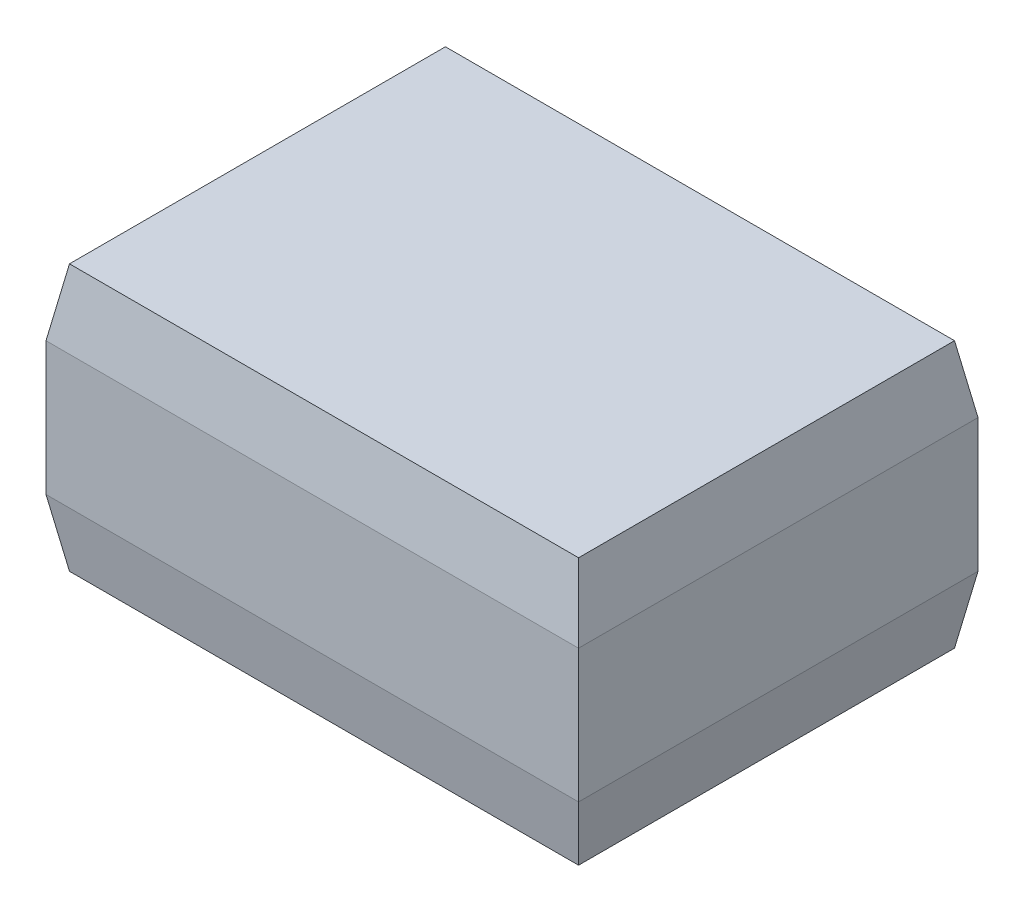
ISO-10303-21;
HEADER;
FILE_DESCRIPTION(('STEP AP214'),'2;1');
FILE_NAME('part.step','',(''),(''),'','','');
FILE_SCHEMA(('AUTOMOTIVE_DESIGN { 1 0 10303 214 1 1 1 1 }'));
ENDSEC;
DATA;
#1=APPLICATION_CONTEXT('core data for automotive mechanical design processes');
#2=APPLICATION_PROTOCOL_DEFINITION('international standard','automotive_design',2000,#1);
#3=PRODUCT_CONTEXT('',#1,'mechanical');
#4=PRODUCT('Part','Part','',(#3));
#5=PRODUCT_RELATED_PRODUCT_CATEGORY('part','',(#4));
#6=PRODUCT_DEFINITION_FORMATION('','',#4);
#7=PRODUCT_DEFINITION_CONTEXT('part definition',#1,'design');
#8=PRODUCT_DEFINITION('design','',#6,#7);
#9=PRODUCT_DEFINITION_SHAPE('','',#8);
#10=(LENGTH_UNIT() NAMED_UNIT(*) SI_UNIT(.MILLI.,.METRE.));
#11=(NAMED_UNIT(*) PLANE_ANGLE_UNIT() SI_UNIT($,.RADIAN.));
#12=(NAMED_UNIT(*) SI_UNIT($,.STERADIAN.) SOLID_ANGLE_UNIT());
#13=UNCERTAINTY_MEASURE_WITH_UNIT(LENGTH_MEASURE(1.E-05),#10,'distance_accuracy_value','');
#14=(GEOMETRIC_REPRESENTATION_CONTEXT(3) GLOBAL_UNCERTAINTY_ASSIGNED_CONTEXT((#13)) GLOBAL_UNIT_ASSIGNED_CONTEXT((#10,
#11,#12)) REPRESENTATION_CONTEXT('',''));
#15=CARTESIAN_POINT('',(0.,0.,0.));
#16=DIRECTION('',(0.,0.,1.));
#17=DIRECTION('',(1.,0.,0.));
#18=AXIS2_PLACEMENT_3D('',#15,#16,#17);
#19=CARTESIAN_POINT('',(0.,2.,0.));
#20=DIRECTION('',(1.,0.,0.));
#21=DIRECTION('',(0.,0.,-1.));
#22=AXIS2_PLACEMENT_3D('',#19,#20,#21);
#23=PLANE('',#22);
#24=DIRECTION('',(0.,-1.,0.));
#25=VECTOR('',#24,1.);
#26=CARTESIAN_POINT('',(0.,2.,-3.));
#27=LINE('',#26,#25);
#28=CARTESIAN_POINT('',(0.,1.49999999999999,-3.));
#29=VERTEX_POINT('',#28);
#30=CARTESIAN_POINT('',(0.,0.500000000000009,-3.));
#31=VERTEX_POINT('',#30);
#32=EDGE_CURVE('E101',#29,#31,#27,.T.);
#33=ORIENTED_EDGE('',*,*,#32,.T.);
#34=DIRECTION('',(0.,0.,1.));
#35=VECTOR('',#34,1.);
#36=CARTESIAN_POINT('',(0.,0.500000000000009,0.));
#37=LINE('',#36,#35);
#38=CARTESIAN_POINT('',(0.,0.500000000000009,0.));
#39=VERTEX_POINT('',#38);
#40=EDGE_CURVE('E37',#31,#39,#37,.T.);
#41=ORIENTED_EDGE('',*,*,#40,.T.);
#42=DIRECTION('',(0.,-1.,0.));
#43=VECTOR('',#42,1.);
#44=CARTESIAN_POINT('',(0.,2.,0.));
#45=LINE('',#44,#43);
#46=CARTESIAN_POINT('',(0.,1.49999999999999,0.));
#47=VERTEX_POINT('',#46);
#48=EDGE_CURVE('E169',#47,#39,#45,.T.);
#49=ORIENTED_EDGE('',*,*,#48,.F.);
#50=DIRECTION('',(0.,0.,-1.));
#51=VECTOR('',#50,1.);
#52=CARTESIAN_POINT('',(0.,1.49999999999999,0.));
#53=LINE('',#52,#51);
#54=EDGE_CURVE('E161',#47,#29,#53,.T.);
#55=ORIENTED_EDGE('',*,*,#54,.T.);
#56=EDGE_LOOP('',(#33,#41,#49,#55));
#57=FACE_BOUND('',#56,.T.);
#58=ADVANCED_FACE('F30',(#57),#23,.F.);
#59=CARTESIAN_POINT('',(0.,2.,0.));
#60=DIRECTION('',(0.,0.,-1.));
#61=DIRECTION('',(-1.,0.,0.));
#62=AXIS2_PLACEMENT_3D('',#59,#60,#61);
#63=PLANE('',#62);
#64=ORIENTED_EDGE('',*,*,#48,.T.);
#65=DIRECTION('',(1.,0.,0.));
#66=VECTOR('',#65,1.);
#67=CARTESIAN_POINT('',(3.91183650964577,0.500000000000009,0.));
#68=LINE('',#67,#66);
#69=CARTESIAN_POINT('',(4.,0.500000000000007,0.));
#70=VERTEX_POINT('',#69);
#71=EDGE_CURVE('E11',#39,#70,#68,.T.);
#72=ORIENTED_EDGE('',*,*,#71,.T.);
#73=DIRECTION('',(0.,-1.,0.));
#74=VECTOR('',#73,1.);
#75=CARTESIAN_POINT('',(4.,2.,0.));
#76=LINE('',#75,#74);
#77=CARTESIAN_POINT('',(4.,1.49999999999999,0.));
#78=VERTEX_POINT('',#77);
#79=EDGE_CURVE('E117',#78,#70,#76,.T.);
#80=ORIENTED_EDGE('',*,*,#79,.F.);
#81=DIRECTION('',(-1.,0.,0.));
#82=VECTOR('',#81,1.);
#83=CARTESIAN_POINT('',(0.,1.49999999999999,0.));
#84=LINE('',#83,#82);
#85=EDGE_CURVE('E131',#78,#47,#84,.T.);
#86=ORIENTED_EDGE('',*,*,#85,.T.);
#87=EDGE_LOOP('',(#64,#72,#80,#86));
#88=FACE_BOUND('',#87,.T.);
#89=ADVANCED_FACE('F192',(#88),#63,.F.);
#90=CARTESIAN_POINT('',(4.,2.,0.));
#91=DIRECTION('',(-1.,0.,0.));
#92=DIRECTION('',(0.,0.,1.));
#93=AXIS2_PLACEMENT_3D('',#90,#91,#92);
#94=PLANE('',#93);
#95=ORIENTED_EDGE('',*,*,#79,.T.);
#96=DIRECTION('',(0.,0.,-1.));
#97=VECTOR('',#96,1.);
#98=CARTESIAN_POINT('',(4.,0.500000000000009,-3.));
#99=LINE('',#98,#97);
#100=CARTESIAN_POINT('',(4.,0.500000000000007,-3.));
#101=VERTEX_POINT('',#100);
#102=EDGE_CURVE('E116',#70,#101,#99,.T.);
#103=ORIENTED_EDGE('',*,*,#102,.T.);
#104=DIRECTION('',(0.,-1.,0.));
#105=VECTOR('',#104,1.);
#106=CARTESIAN_POINT('',(4.,2.,-3.));
#107=LINE('',#106,#105);
#108=CARTESIAN_POINT('',(4.,1.49999999999999,-3.));
#109=VERTEX_POINT('',#108);
#110=EDGE_CURVE('E99',#109,#101,#107,.T.);
#111=ORIENTED_EDGE('',*,*,#110,.F.);
#112=DIRECTION('',(0.,0.,1.));
#113=VECTOR('',#112,1.);
#114=CARTESIAN_POINT('',(4.,1.49999999999999,0.));
#115=LINE('',#114,#113);
#116=EDGE_CURVE('E113',#109,#78,#115,.T.);
#117=ORIENTED_EDGE('',*,*,#116,.T.);
#118=EDGE_LOOP('',(#95,#103,#111,#117));
#119=FACE_BOUND('',#118,.T.);
#120=ADVANCED_FACE('F112',(#119),#94,.F.);
#121=CARTESIAN_POINT('',(0.,2.,-3.));
#122=DIRECTION('',(0.,0.,1.));
#123=DIRECTION('',(1.,0.,0.));
#124=AXIS2_PLACEMENT_3D('',#121,#122,#123);
#125=PLANE('',#124);
#126=ORIENTED_EDGE('',*,*,#110,.T.);
#127=DIRECTION('',(-1.,0.,0.));
#128=VECTOR('',#127,1.);
#129=CARTESIAN_POINT('',(0.,0.500000000000009,-3.));
#130=LINE('',#129,#128);
#131=EDGE_CURVE('E140',#101,#31,#130,.T.);
#132=ORIENTED_EDGE('',*,*,#131,.T.);
#133=ORIENTED_EDGE('',*,*,#32,.F.);
#134=DIRECTION('',(1.,0.,0.));
#135=VECTOR('',#134,1.);
#136=CARTESIAN_POINT('',(0.,1.49999999999999,-3.));
#137=LINE('',#136,#135);
#138=EDGE_CURVE('E95',#29,#109,#137,.T.);
#139=ORIENTED_EDGE('',*,*,#138,.T.);
#140=EDGE_LOOP('',(#126,#132,#133,#139));
#141=FACE_BOUND('',#140,.T.);
#142=ADVANCED_FACE('F97',(#141),#125,.F.);
#143=CARTESIAN_POINT('',(0.,2.,-3.));
#144=DIRECTION('',(0.,-1.,0.));
#145=DIRECTION('',(0.,0.,-1.));
#146=AXIS2_PLACEMENT_3D('',#143,#144,#145);
#147=PLANE('',#146);
#148=DIRECTION('',(0.,0.,-1.));
#149=VECTOR('',#148,1.);
#150=CARTESIAN_POINT('',(3.91183650964576,2.,-3.));
#151=LINE('',#150,#149);
#152=CARTESIAN_POINT('',(3.91183650964577,2.,-0.0881634903542325));
#153=VERTEX_POINT('',#152);
#154=CARTESIAN_POINT('',(3.91183650964576,2.,-2.91183650964577));
#155=VERTEX_POINT('',#154);
#156=EDGE_CURVE('E125',#153,#155,#151,.T.);
#157=ORIENTED_EDGE('',*,*,#156,.T.);
#158=DIRECTION('',(-1.,0.,0.));
#159=VECTOR('',#158,1.);
#160=CARTESIAN_POINT('',(0.,2.,-2.91183650964577));
#161=LINE('',#160,#159);
#162=CARTESIAN_POINT('',(0.0881634903542292,2.,-2.91183650964577));
#163=VERTEX_POINT('',#162);
#164=EDGE_CURVE('E130',#155,#163,#161,.T.);
#165=ORIENTED_EDGE('',*,*,#164,.T.);
#166=DIRECTION('',(0.,0.,1.));
#167=VECTOR('',#166,1.);
#168=CARTESIAN_POINT('',(0.0881634903542291,2.,-3.));
#169=LINE('',#168,#167);
#170=CARTESIAN_POINT('',(0.0881634903542325,2.,-0.0881634903542326));
#171=VERTEX_POINT('',#170);
#172=EDGE_CURVE('E124',#163,#171,#169,.T.);
#173=ORIENTED_EDGE('',*,*,#172,.T.);
#174=DIRECTION('',(1.,0.,0.));
#175=VECTOR('',#174,1.);
#176=CARTESIAN_POINT('',(0.,2.,-0.0881634903542325));
#177=LINE('',#176,#175);
#178=EDGE_CURVE('E175',#171,#153,#177,.T.);
#179=ORIENTED_EDGE('',*,*,#178,.T.);
#180=EDGE_LOOP('',(#157,#165,#173,#179));
#181=FACE_BOUND('',#180,.T.);
#182=ADVANCED_FACE('F186',(#181),#147,.F.);
#183=CARTESIAN_POINT('',(0.,0.,-3.));
#184=DIRECTION('',(0.,-1.,0.));
#185=DIRECTION('',(0.,0.,-1.));
#186=AXIS2_PLACEMENT_3D('',#183,#184,#185);
#187=PLANE('',#186);
#188=DIRECTION('',(0.,0.,-1.));
#189=VECTOR('',#188,1.);
#190=CARTESIAN_POINT('',(0.0881634903542289,0.,-3.));
#191=LINE('',#190,#189);
#192=CARTESIAN_POINT('',(0.0881634903542323,0.,-0.0881634903542325));
#193=VERTEX_POINT('',#192);
#194=CARTESIAN_POINT('',(0.088163490354229,0.,-2.91183650964577));
#195=VERTEX_POINT('',#194);
#196=EDGE_CURVE('E51',#193,#195,#191,.T.);
#197=ORIENTED_EDGE('',*,*,#196,.T.);
#198=DIRECTION('',(1.,0.,0.));
#199=VECTOR('',#198,1.);
#200=CARTESIAN_POINT('',(3.91183650964576,0.,-2.91183650964577));
#201=LINE('',#200,#199);
#202=CARTESIAN_POINT('',(3.91183650964576,0.,-2.91183650964577));
#203=VERTEX_POINT('',#202);
#204=EDGE_CURVE('E145',#195,#203,#201,.T.);
#205=ORIENTED_EDGE('',*,*,#204,.T.);
#206=DIRECTION('',(0.,0.,1.));
#207=VECTOR('',#206,1.);
#208=CARTESIAN_POINT('',(3.91183650964577,0.,0.));
#209=LINE('',#208,#207);
#210=CARTESIAN_POINT('',(3.91183650964577,0.,-0.0881634903542325));
#211=VERTEX_POINT('',#210);
#212=EDGE_CURVE('E137',#203,#211,#209,.T.);
#213=ORIENTED_EDGE('',*,*,#212,.T.);
#214=DIRECTION('',(-1.,0.,0.));
#215=VECTOR('',#214,1.);
#216=CARTESIAN_POINT('',(0.,0.,-0.0881634903542325));
#217=LINE('',#216,#215);
#218=EDGE_CURVE('E142',#211,#193,#217,.T.);
#219=ORIENTED_EDGE('',*,*,#218,.T.);
#220=EDGE_LOOP('',(#197,#205,#213,#219));
#221=FACE_BOUND('',#220,.T.);
#222=ADVANCED_FACE('F221',(#221),#187,.T.);
#223=CARTESIAN_POINT('',(3.91183650964576,2.,-3.));
#224=DIRECTION('',(-0.984807753012209,-0.173648177666927,0.));
#225=DIRECTION('',(0.173648177666927,-0.984807753012209,0.));
#226=AXIS2_PLACEMENT_3D('',#223,#224,#225);
#227=PLANE('',#226);
#228=ORIENTED_EDGE('',*,*,#116,.F.);
#229=DIRECTION('',(-0.171087869746032,0.970287525247815,0.171087869746032));
#230=VECTOR('',#229,1.);
#231=CARTESIAN_POINT('',(3.91441714838893,1.98536447041288,-2.91441714838893));
#232=LINE('',#231,#230);
#233=EDGE_CURVE('E122',#109,#155,#232,.T.);
#234=ORIENTED_EDGE('',*,*,#233,.T.);
#235=ORIENTED_EDGE('',*,*,#156,.F.);
#236=DIRECTION('',(0.171087869746033,-0.970287525247815,0.171087869746033));
#237=VECTOR('',#236,1.);
#238=CARTESIAN_POINT('',(3.82660397086623,2.48337774762028,-0.173396029133773));
#239=LINE('',#238,#237);
#240=EDGE_CURVE('E104',#153,#78,#239,.T.);
#241=ORIENTED_EDGE('',*,*,#240,.T.);
#242=EDGE_LOOP('',(#228,#234,#235,#241));
#243=FACE_BOUND('',#242,.T.);
#244=ADVANCED_FACE('F120',(#243),#227,.F.);
#245=CARTESIAN_POINT('',(0.0881634903542291,2.,-3.));
#246=DIRECTION('',(0.984807753012209,-0.173648177666927,0.));
#247=DIRECTION('',(0.173648177666927,0.984807753012209,0.));
#248=AXIS2_PLACEMENT_3D('',#245,#246,#247);
#249=PLANE('',#248);
#250=ORIENTED_EDGE('',*,*,#172,.F.);
#251=DIRECTION('',(-0.171087869746033,-0.970287525247815,-0.171087869746032));
#252=VECTOR('',#251,1.);
#253=CARTESIAN_POINT('',(0.0855828516110633,1.98536447041288,-2.91441714838893));
#254=LINE('',#253,#252);
#255=EDGE_CURVE('E105',#163,#29,#254,.T.);
#256=ORIENTED_EDGE('',*,*,#255,.T.);
#257=ORIENTED_EDGE('',*,*,#54,.F.);
#258=DIRECTION('',(0.171087869746032,0.970287525247815,-0.171087869746033));
#259=VECTOR('',#258,1.);
#260=CARTESIAN_POINT('',(0.173396029133773,2.48337774762028,-0.173396029133773));
#261=LINE('',#260,#259);
#262=EDGE_CURVE('E179',#47,#171,#261,.T.);
#263=ORIENTED_EDGE('',*,*,#262,.T.);
#264=EDGE_LOOP('',(#250,#256,#257,#263));
#265=FACE_BOUND('',#264,.T.);
#266=ADVANCED_FACE('F183',(#265),#249,.F.);
#267=CARTESIAN_POINT('',(0.,2.,-2.91183650964577));
#268=DIRECTION('',(0.,-0.173648177666927,0.984807753012209));
#269=DIRECTION('',(0.,-0.984807753012209,-0.173648177666927));
#270=AXIS2_PLACEMENT_3D('',#267,#268,#269);
#271=PLANE('',#270);
#272=ORIENTED_EDGE('',*,*,#233,.F.);
#273=ORIENTED_EDGE('',*,*,#138,.F.);
#274=ORIENTED_EDGE('',*,*,#255,.F.);
#275=ORIENTED_EDGE('',*,*,#164,.F.);
#276=EDGE_LOOP('',(#272,#273,#274,#275));
#277=FACE_BOUND('',#276,.T.);
#278=ADVANCED_FACE('F128',(#277),#271,.F.);
#279=CARTESIAN_POINT('',(0.,2.,-0.0881634903542325));
#280=DIRECTION('',(0.,-0.173648177666927,-0.984807753012209));
#281=DIRECTION('',(0.,0.984807753012209,-0.173648177666927));
#282=AXIS2_PLACEMENT_3D('',#279,#280,#281);
#283=PLANE('',#282);
#284=ORIENTED_EDGE('',*,*,#262,.F.);
#285=ORIENTED_EDGE('',*,*,#85,.F.);
#286=ORIENTED_EDGE('',*,*,#240,.F.);
#287=ORIENTED_EDGE('',*,*,#178,.F.);
#288=EDGE_LOOP('',(#284,#285,#286,#287));
#289=FACE_BOUND('',#288,.T.);
#290=ADVANCED_FACE('F189',(#289),#283,.F.);
#291=CARTESIAN_POINT('',(4.,0.500000000000009,0.));
#292=DIRECTION('',(0.984807753012209,-0.173648177666927,0.));
#293=DIRECTION('',(0.173648177666927,0.984807753012209,0.));
#294=AXIS2_PLACEMENT_3D('',#291,#292,#293);
#295=PLANE('',#294);
#296=ORIENTED_EDGE('',*,*,#212,.F.);
#297=DIRECTION('',(0.171087869746032,0.970287525247815,-0.171087869746033));
#298=VECTOR('',#297,1.);
#299=CARTESIAN_POINT('',(3.91218682247729,0.001986722792614,-2.91218682247729));
#300=LINE('',#299,#298);
#301=EDGE_CURVE('E149',#203,#101,#300,.T.);
#302=ORIENTED_EDGE('',*,*,#301,.T.);
#303=ORIENTED_EDGE('',*,*,#102,.F.);
#304=DIRECTION('',(-0.171087869746033,-0.970287525247815,-0.171087869746033));
#305=VECTOR('',#304,1.);
#306=CARTESIAN_POINT('',(4.,0.500000000000009,0.));
#307=LINE('',#306,#305);
#308=EDGE_CURVE('E147',#70,#211,#307,.T.);
#309=ORIENTED_EDGE('',*,*,#308,.T.);
#310=EDGE_LOOP('',(#296,#302,#303,#309));
#311=FACE_BOUND('',#310,.T.);
#312=ADVANCED_FACE('F153',(#311),#295,.T.);
#313=CARTESIAN_POINT('',(0.,0.500000000000009,0.));
#314=DIRECTION('',(0.,-0.173648177666927,0.984807753012209));
#315=DIRECTION('',(0.,-0.984807753012209,-0.173648177666927));
#316=AXIS2_PLACEMENT_3D('',#313,#314,#315);
#317=PLANE('',#316);
#318=ORIENTED_EDGE('',*,*,#308,.F.);
#319=ORIENTED_EDGE('',*,*,#71,.F.);
#320=DIRECTION('',(0.171087869746032,-0.970287525247815,-0.171087869746033));
#321=VECTOR('',#320,1.);
#322=CARTESIAN_POINT('',(0.,0.500000000000009,0.));
#323=LINE('',#322,#321);
#324=EDGE_CURVE('E162',#193,#39,#323,.F.);
#325=ORIENTED_EDGE('',*,*,#324,.F.);
#326=ORIENTED_EDGE('',*,*,#218,.F.);
#327=EDGE_LOOP('',(#318,#319,#325,#326));
#328=FACE_BOUND('',#327,.T.);
#329=ADVANCED_FACE('F196',(#328),#317,.T.);
#330=CARTESIAN_POINT('',(0.,0.500000000000009,0.));
#331=DIRECTION('',(-0.984807753012209,-0.173648177666927,0.));
#332=DIRECTION('',(0.173648177666927,-0.984807753012209,0.));
#333=AXIS2_PLACEMENT_3D('',#330,#331,#332);
#334=PLANE('',#333);
#335=ORIENTED_EDGE('',*,*,#324,.T.);
#336=ORIENTED_EDGE('',*,*,#40,.F.);
#337=DIRECTION('',(0.171087869746033,-0.970287525247815,0.171087869746033));
#338=VECTOR('',#337,1.);
#339=CARTESIAN_POINT('',(0.0878131775227029,0.00198672279261292,-2.91218682247729));
#340=LINE('',#339,#338);
#341=EDGE_CURVE('E158',#195,#31,#340,.F.);
#342=ORIENTED_EDGE('',*,*,#341,.F.);
#343=ORIENTED_EDGE('',*,*,#196,.F.);
#344=EDGE_LOOP('',(#335,#336,#342,#343));
#345=FACE_BOUND('',#344,.T.);
#346=ADVANCED_FACE('F199',(#345),#334,.T.);
#347=CARTESIAN_POINT('',(0.,0.500000000000009,-3.));
#348=DIRECTION('',(0.,-0.173648177666927,-0.984807753012209));
#349=DIRECTION('',(0.,0.984807753012209,-0.173648177666927));
#350=AXIS2_PLACEMENT_3D('',#347,#348,#349);
#351=PLANE('',#350);
#352=ORIENTED_EDGE('',*,*,#301,.F.);
#353=ORIENTED_EDGE('',*,*,#204,.F.);
#354=ORIENTED_EDGE('',*,*,#341,.T.);
#355=ORIENTED_EDGE('',*,*,#131,.F.);
#356=EDGE_LOOP('',(#352,#353,#354,#355));
#357=FACE_BOUND('',#356,.T.);
#358=ADVANCED_FACE('F156',(#357),#351,.T.);
#359=CLOSED_SHELL('',(#58,#89,#120,#142,#182,#222,#244,#266,#278,#290,#312,#329,#346,#358));
#360=MANIFOLD_SOLID_BREP('B2',#359);
#361=ADVANCED_BREP_SHAPE_REPRESENTATION('',(#18,#360),#14);
#362=SHAPE_DEFINITION_REPRESENTATION(#9,#361);
ENDSEC;
END-ISO-10303-21;
